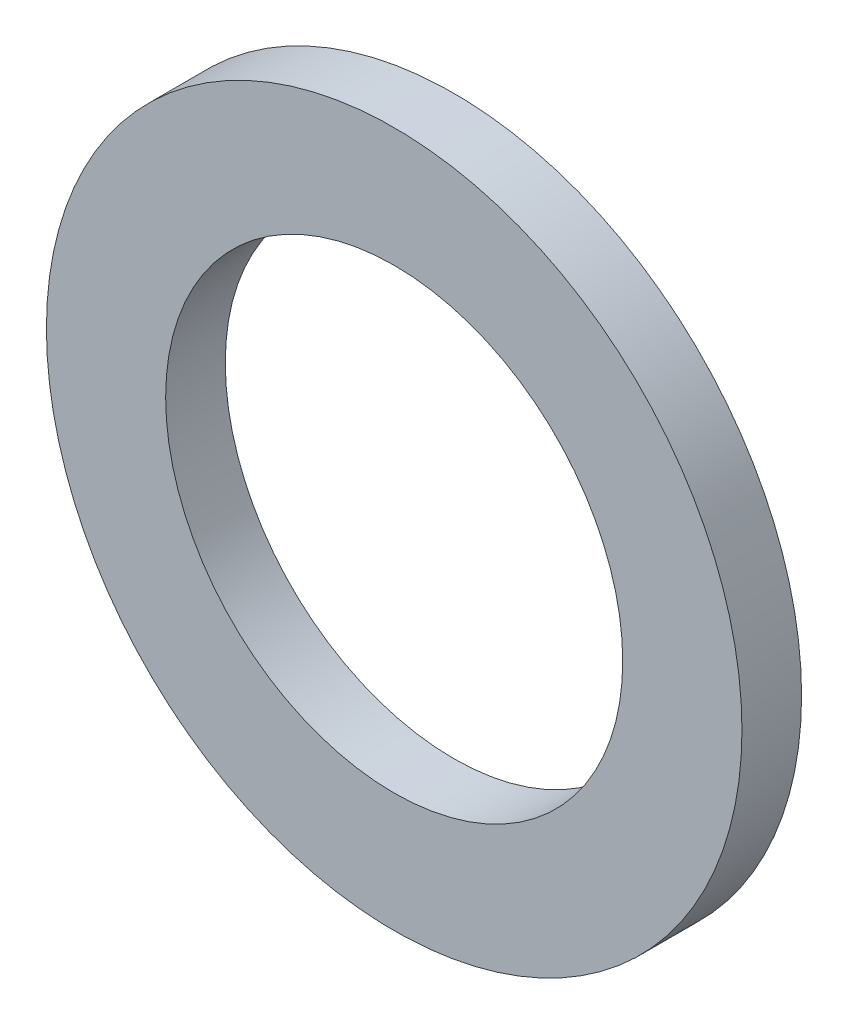
ISO-10303-21;
HEADER;
FILE_DESCRIPTION(('STEP AP214'),'2;1');
FILE_NAME('part.step','',(''),(''),'','','');
FILE_SCHEMA(('AUTOMOTIVE_DESIGN { 1 0 10303 214 1 1 1 1 }'));
ENDSEC;
DATA;
#1=APPLICATION_CONTEXT('core data for automotive mechanical design processes');
#2=APPLICATION_PROTOCOL_DEFINITION('international standard','automotive_design',2000,#1);
#3=PRODUCT_CONTEXT('',#1,'mechanical');
#4=PRODUCT('Part','Part','',(#3));
#5=PRODUCT_RELATED_PRODUCT_CATEGORY('part','',(#4));
#6=PRODUCT_DEFINITION_FORMATION('','',#4);
#7=PRODUCT_DEFINITION_CONTEXT('part definition',#1,'design');
#8=PRODUCT_DEFINITION('design','',#6,#7);
#9=PRODUCT_DEFINITION_SHAPE('','',#8);
#10=(LENGTH_UNIT() NAMED_UNIT(*) SI_UNIT(.MILLI.,.METRE.));
#11=(NAMED_UNIT(*) PLANE_ANGLE_UNIT() SI_UNIT($,.RADIAN.));
#12=(NAMED_UNIT(*) SI_UNIT($,.STERADIAN.) SOLID_ANGLE_UNIT());
#13=UNCERTAINTY_MEASURE_WITH_UNIT(LENGTH_MEASURE(1.E-05),#10,'distance_accuracy_value','');
#14=(GEOMETRIC_REPRESENTATION_CONTEXT(3) GLOBAL_UNCERTAINTY_ASSIGNED_CONTEXT((#13)) GLOBAL_UNIT_ASSIGNED_CONTEXT((#10,
#11,#12)) REPRESENTATION_CONTEXT('',''));
#15=CARTESIAN_POINT('',(0.,0.,0.));
#16=DIRECTION('',(0.,0.,1.));
#17=DIRECTION('',(1.,0.,0.));
#18=AXIS2_PLACEMENT_3D('',#15,#16,#17);
#19=CARTESIAN_POINT('',(0.,0.,3.));
#20=DIRECTION('',(0.,0.,1.));
#21=DIRECTION('',(1.,0.,0.));
#22=AXIS2_PLACEMENT_3D('',#19,#20,#21);
#23=PLANE('',#22);
#24=CARTESIAN_POINT('',(0.,0.,3.));
#25=DIRECTION('',(0.,0.,1.));
#26=DIRECTION('',(1.,0.,0.));
#27=AXIS2_PLACEMENT_3D('',#24,#25,#26);
#28=CIRCLE('',#27,17.5);
#29=CARTESIAN_POINT('',(17.5,0.,3.));
#30=VERTEX_POINT('',#29);
#31=EDGE_CURVE('E10',#30,#30,#28,.T.);
#32=ORIENTED_EDGE('',*,*,#31,.T.);
#33=EDGE_LOOP('',(#32));
#34=FACE_BOUND('',#33,.T.);
#35=CARTESIAN_POINT('',(0.,0.,3.));
#36=DIRECTION('',(0.,0.,1.));
#37=DIRECTION('',(1.,0.,0.));
#38=AXIS2_PLACEMENT_3D('',#35,#36,#37);
#39=CIRCLE('',#38,11.5);
#40=CARTESIAN_POINT('',(11.5,0.,3.));
#41=VERTEX_POINT('',#40);
#42=EDGE_CURVE('E42',#41,#41,#39,.T.);
#43=ORIENTED_EDGE('',*,*,#42,.F.);
#44=EDGE_LOOP('',(#43));
#45=FACE_BOUND('',#44,.T.);
#46=ADVANCED_FACE('F31',(#34,#45),#23,.T.);
#47=CARTESIAN_POINT('',(0.,0.,0.));
#48=DIRECTION('',(0.,0.,1.));
#49=DIRECTION('',(1.,0.,0.));
#50=AXIS2_PLACEMENT_3D('',#47,#48,#49);
#51=PLANE('',#50);
#52=CARTESIAN_POINT('',(0.,0.,0.));
#53=DIRECTION('',(0.,0.,1.));
#54=DIRECTION('',(1.,0.,0.));
#55=AXIS2_PLACEMENT_3D('',#52,#53,#54);
#56=CIRCLE('',#55,17.5);
#57=CARTESIAN_POINT('',(17.5,0.,0.));
#58=VERTEX_POINT('',#57);
#59=EDGE_CURVE('E35',#58,#58,#56,.T.);
#60=ORIENTED_EDGE('',*,*,#59,.F.);
#61=EDGE_LOOP('',(#60));
#62=FACE_BOUND('',#61,.T.);
#63=CARTESIAN_POINT('',(0.,0.,0.));
#64=DIRECTION('',(0.,0.,1.));
#65=DIRECTION('',(1.,0.,0.));
#66=AXIS2_PLACEMENT_3D('',#63,#64,#65);
#67=CIRCLE('',#66,11.5);
#68=CARTESIAN_POINT('',(11.5,0.,0.));
#69=VERTEX_POINT('',#68);
#70=EDGE_CURVE('E44',#69,#69,#67,.T.);
#71=ORIENTED_EDGE('',*,*,#70,.T.);
#72=EDGE_LOOP('',(#71));
#73=FACE_BOUND('',#72,.T.);
#74=ADVANCED_FACE('F54',(#62,#73),#51,.F.);
#75=CARTESIAN_POINT('',(0.,0.,3.));
#76=DIRECTION('',(0.,0.,-1.));
#77=DIRECTION('',(-1.,0.,0.));
#78=AXIS2_PLACEMENT_3D('',#75,#76,#77);
#79=CYLINDRICAL_SURFACE('',#78,17.5);
#80=ORIENTED_EDGE('',*,*,#31,.F.);
#81=EDGE_LOOP('',(#80));
#82=FACE_BOUND('',#81,.T.);
#83=ORIENTED_EDGE('',*,*,#59,.T.);
#84=EDGE_LOOP('',(#83));
#85=FACE_BOUND('',#84,.T.);
#86=ADVANCED_FACE('F33',(#82,#85),#79,.T.);
#87=CARTESIAN_POINT('',(0.,0.,3.));
#88=DIRECTION('',(0.,0.,-1.));
#89=DIRECTION('',(-1.,0.,0.));
#90=AXIS2_PLACEMENT_3D('',#87,#88,#89);
#91=CYLINDRICAL_SURFACE('',#90,11.5);
#92=ORIENTED_EDGE('',*,*,#42,.T.);
#93=EDGE_LOOP('',(#92));
#94=FACE_BOUND('',#93,.T.);
#95=ORIENTED_EDGE('',*,*,#70,.F.);
#96=EDGE_LOOP('',(#95));
#97=FACE_BOUND('',#96,.T.);
#98=ADVANCED_FACE('F50',(#94,#97),#91,.F.);
#99=CLOSED_SHELL('',(#46,#74,#86,#98));
#100=MANIFOLD_SOLID_BREP('B2',#99);
#101=ADVANCED_BREP_SHAPE_REPRESENTATION('',(#18,#100),#14);
#102=SHAPE_DEFINITION_REPRESENTATION(#9,#101);
ENDSEC;
END-ISO-10303-21;
